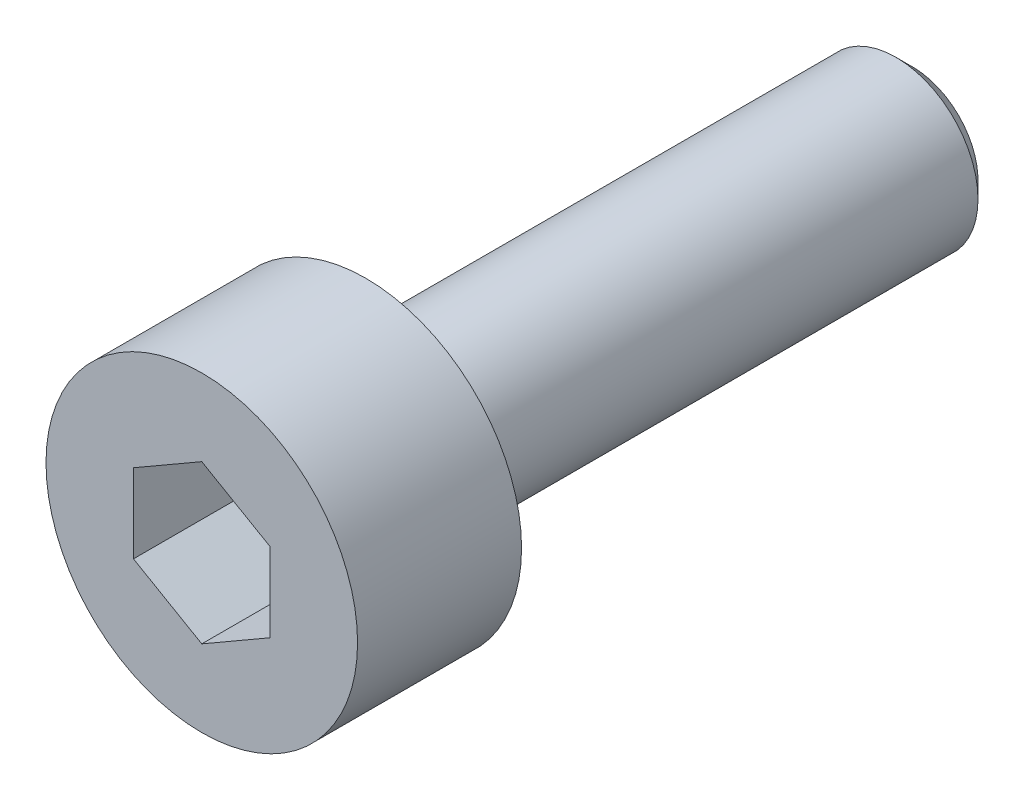
ISO-10303-21;
HEADER;
FILE_DESCRIPTION(('STEP AP214'),'2;1');
FILE_NAME('part.step','',(''),(''),'','','');
FILE_SCHEMA(('AUTOMOTIVE_DESIGN { 1 0 10303 214 1 1 1 1 }'));
ENDSEC;
DATA;
#1=APPLICATION_CONTEXT('core data for automotive mechanical design processes');
#2=APPLICATION_PROTOCOL_DEFINITION('international standard','automotive_design',2000,#1);
#3=PRODUCT_CONTEXT('',#1,'mechanical');
#4=PRODUCT('Part','Part','',(#3));
#5=PRODUCT_RELATED_PRODUCT_CATEGORY('part','',(#4));
#6=PRODUCT_DEFINITION_FORMATION('','',#4);
#7=PRODUCT_DEFINITION_CONTEXT('part definition',#1,'design');
#8=PRODUCT_DEFINITION('design','',#6,#7);
#9=PRODUCT_DEFINITION_SHAPE('','',#8);
#10=(LENGTH_UNIT() NAMED_UNIT(*) SI_UNIT(.MILLI.,.METRE.));
#11=(NAMED_UNIT(*) PLANE_ANGLE_UNIT() SI_UNIT($,.RADIAN.));
#12=(NAMED_UNIT(*) SI_UNIT($,.STERADIAN.) SOLID_ANGLE_UNIT());
#13=UNCERTAINTY_MEASURE_WITH_UNIT(LENGTH_MEASURE(1.E-05),#10,'distance_accuracy_value','');
#14=(GEOMETRIC_REPRESENTATION_CONTEXT(3) GLOBAL_UNCERTAINTY_ASSIGNED_CONTEXT((#13)) GLOBAL_UNIT_ASSIGNED_CONTEXT((#10,
#11,#12)) REPRESENTATION_CONTEXT('',''));
#15=CARTESIAN_POINT('',(0.,0.,0.));
#16=DIRECTION('',(0.,0.,1.));
#17=DIRECTION('',(1.,0.,0.));
#18=AXIS2_PLACEMENT_3D('',#15,#16,#17);
#19=CARTESIAN_POINT('',(0.,0.,0.));
#20=DIRECTION('',(0.,0.,1.));
#21=DIRECTION('',(1.,0.,0.));
#22=AXIS2_PLACEMENT_3D('',#19,#20,#21);
#23=PLANE('',#22);
#24=CARTESIAN_POINT('',(0.,0.,0.));
#25=DIRECTION('',(0.,0.,1.));
#26=DIRECTION('',(1.,0.,0.));
#27=AXIS2_PLACEMENT_3D('',#24,#25,#26);
#28=CIRCLE('',#27,2.85);
#29=CARTESIAN_POINT('',(2.85,0.,0.));
#30=VERTEX_POINT('',#29);
#31=EDGE_CURVE('E137',#30,#30,#28,.T.);
#32=ORIENTED_EDGE('',*,*,#31,.F.);
#33=EDGE_LOOP('',(#32));
#34=FACE_BOUND('',#33,.T.);
#35=CARTESIAN_POINT('',(0.,0.,0.));
#36=DIRECTION('',(0.,0.,1.));
#37=DIRECTION('',(1.,0.,0.));
#38=AXIS2_PLACEMENT_3D('',#35,#36,#37);
#39=CIRCLE('',#38,1.5);
#40=CARTESIAN_POINT('',(1.5,0.,0.));
#41=VERTEX_POINT('',#40);
#42=EDGE_CURVE('E146',#41,#41,#39,.F.);
#43=ORIENTED_EDGE('',*,*,#42,.F.);
#44=EDGE_LOOP('',(#43));
#45=FACE_BOUND('',#44,.T.);
#46=ADVANCED_FACE('F35',(#34,#45),#23,.F.);
#47=CARTESIAN_POINT('',(0.,0.,3.));
#48=DIRECTION('',(0.,0.,-1.));
#49=DIRECTION('',(-1.,0.,0.));
#50=AXIS2_PLACEMENT_3D('',#47,#48,#49);
#51=CYLINDRICAL_SURFACE('',#50,2.85);
#52=CARTESIAN_POINT('',(0.,0.,3.));
#53=DIRECTION('',(0.,0.,1.));
#54=DIRECTION('',(1.,0.,0.));
#55=AXIS2_PLACEMENT_3D('',#52,#53,#54);
#56=CIRCLE('',#55,2.85);
#57=CARTESIAN_POINT('',(2.85,0.,3.));
#58=VERTEX_POINT('',#57);
#59=EDGE_CURVE('E143',#58,#58,#56,.T.);
#60=ORIENTED_EDGE('',*,*,#59,.F.);
#61=EDGE_LOOP('',(#60));
#62=FACE_BOUND('',#61,.T.);
#63=ORIENTED_EDGE('',*,*,#31,.T.);
#64=EDGE_LOOP('',(#63));
#65=FACE_BOUND('',#64,.T.);
#66=ADVANCED_FACE('F168',(#62,#65),#51,.T.);
#67=CARTESIAN_POINT('',(0.,0.,3.));
#68=DIRECTION('',(0.,0.,1.));
#69=DIRECTION('',(1.,0.,0.));
#70=AXIS2_PLACEMENT_3D('',#67,#68,#69);
#71=PLANE('',#70);
#72=DIRECTION('',(-0.866025403784439,0.5,0.));
#73=VECTOR('',#72,1.);
#74=CARTESIAN_POINT('',(1.25,0.721687836487032,3.));
#75=LINE('',#74,#73);
#76=CARTESIAN_POINT('',(1.25,0.721687836487032,3.));
#77=VERTEX_POINT('',#76);
#78=CARTESIAN_POINT('',(0.,1.44337567297406,3.));
#79=VERTEX_POINT('',#78);
#80=EDGE_CURVE('E50',#77,#79,#75,.T.);
#81=ORIENTED_EDGE('',*,*,#80,.F.);
#82=DIRECTION('',(0.,1.,0.));
#83=VECTOR('',#82,1.);
#84=CARTESIAN_POINT('',(1.25,-0.721687836487032,3.));
#85=LINE('',#84,#83);
#86=CARTESIAN_POINT('',(1.25,-0.721687836487032,3.));
#87=VERTEX_POINT('',#86);
#88=EDGE_CURVE('E133',#87,#77,#85,.T.);
#89=ORIENTED_EDGE('',*,*,#88,.F.);
#90=DIRECTION('',(0.866025403784439,0.5,0.));
#91=VECTOR('',#90,1.);
#92=CARTESIAN_POINT('',(0.,-1.44337567297406,3.));
#93=LINE('',#92,#91);
#94=CARTESIAN_POINT('',(0.,-1.44337567297406,3.));
#95=VERTEX_POINT('',#94);
#96=EDGE_CURVE('E131',#95,#87,#93,.T.);
#97=ORIENTED_EDGE('',*,*,#96,.F.);
#98=DIRECTION('',(0.866025403784439,-0.5,0.));
#99=VECTOR('',#98,1.);
#100=CARTESIAN_POINT('',(-1.25,-0.721687836487033,3.));
#101=LINE('',#100,#99);
#102=CARTESIAN_POINT('',(-1.25,-0.721687836487033,3.));
#103=VERTEX_POINT('',#102);
#104=EDGE_CURVE('E98',#103,#95,#101,.T.);
#105=ORIENTED_EDGE('',*,*,#104,.F.);
#106=DIRECTION('',(0.,-1.,0.));
#107=VECTOR('',#106,1.);
#108=CARTESIAN_POINT('',(-1.25,0.721687836487032,3.));
#109=LINE('',#108,#107);
#110=CARTESIAN_POINT('',(-1.25,0.721687836487032,3.));
#111=VERTEX_POINT('',#110);
#112=EDGE_CURVE('E127',#111,#103,#109,.T.);
#113=ORIENTED_EDGE('',*,*,#112,.F.);
#114=DIRECTION('',(-0.866025403784439,-0.5,0.));
#115=VECTOR('',#114,1.);
#116=CARTESIAN_POINT('',(0.,1.44337567297406,3.));
#117=LINE('',#116,#115);
#118=EDGE_CURVE('E124',#79,#111,#117,.T.);
#119=ORIENTED_EDGE('',*,*,#118,.F.);
#120=EDGE_LOOP('',(#81,#89,#97,#105,#113,#119));
#121=FACE_BOUND('',#120,.T.);
#122=ORIENTED_EDGE('',*,*,#59,.T.);
#123=EDGE_LOOP('',(#122));
#124=FACE_BOUND('',#123,.T.);
#125=ADVANCED_FACE('F174',(#121,#124),#71,.T.);
#126=CARTESIAN_POINT('',(0.,0.,-10.));
#127=DIRECTION('',(0.,0.,1.));
#128=DIRECTION('',(1.,0.,0.));
#129=AXIS2_PLACEMENT_3D('',#126,#127,#128);
#130=CYLINDRICAL_SURFACE('',#129,1.5);
#131=CARTESIAN_POINT('',(0.,0.,-9.7));
#132=DIRECTION('',(0.,0.,-1.));
#133=DIRECTION('',(-1.,0.,0.));
#134=AXIS2_PLACEMENT_3D('',#131,#132,#133);
#135=CIRCLE('',#134,1.5);
#136=CARTESIAN_POINT('',(-1.5,0.,-9.7));
#137=VERTEX_POINT('',#136);
#138=EDGE_CURVE('E11',#137,#137,#135,.F.);
#139=ORIENTED_EDGE('',*,*,#138,.T.);
#140=EDGE_LOOP('',(#139));
#141=FACE_BOUND('',#140,.T.);
#142=ORIENTED_EDGE('',*,*,#42,.T.);
#143=EDGE_LOOP('',(#142));
#144=FACE_BOUND('',#143,.T.);
#145=ADVANCED_FACE('F164',(#141,#144),#130,.T.);
#146=CARTESIAN_POINT('',(0.,0.,-10.));
#147=DIRECTION('',(0.,0.,-1.));
#148=DIRECTION('',(-1.,0.,0.));
#149=AXIS2_PLACEMENT_3D('',#146,#147,#148);
#150=PLANE('',#149);
#151=CARTESIAN_POINT('',(0.,0.,-10.));
#152=DIRECTION('',(0.,0.,-1.));
#153=DIRECTION('',(-1.,0.,0.));
#154=AXIS2_PLACEMENT_3D('',#151,#152,#153);
#155=CIRCLE('',#154,1.2);
#156=CARTESIAN_POINT('',(-1.2,0.,-10.));
#157=VERTEX_POINT('',#156);
#158=EDGE_CURVE('E43',#157,#157,#155,.T.);
#159=ORIENTED_EDGE('',*,*,#158,.T.);
#160=EDGE_LOOP('',(#159));
#161=FACE_BOUND('',#160,.T.);
#162=ADVANCED_FACE('F153',(#161),#150,.T.);
#163=CARTESIAN_POINT('',(0.,0.,-10.));
#164=DIRECTION('',(0.,0.,1.));
#165=DIRECTION('',(1.,0.,0.));
#166=AXIS2_PLACEMENT_3D('',#163,#164,#165);
#167=CONICAL_SURFACE('',#166,1.2,0.785398163397444);
#168=ORIENTED_EDGE('',*,*,#138,.F.);
#169=EDGE_LOOP('',(#168));
#170=FACE_BOUND('',#169,.T.);
#171=ORIENTED_EDGE('',*,*,#158,.F.);
#172=EDGE_LOOP('',(#171));
#173=FACE_BOUND('',#172,.T.);
#174=ADVANCED_FACE('F37',(#170,#173),#167,.T.);
#175=CARTESIAN_POINT('',(1.25,0.721687836487032,1.));
#176=DIRECTION('',(0.5,0.866025403784439,0.));
#177=DIRECTION('',(-0.866025403784439,0.5,0.));
#178=AXIS2_PLACEMENT_3D('',#175,#176,#177);
#179=PLANE('',#178);
#180=ORIENTED_EDGE('',*,*,#80,.T.);
#181=DIRECTION('',(0.,0.,1.));
#182=VECTOR('',#181,1.);
#183=CARTESIAN_POINT('',(0.,1.44337567297406,1.));
#184=LINE('',#183,#182);
#185=CARTESIAN_POINT('',(0.,1.44337567297406,1.));
#186=VERTEX_POINT('',#185);
#187=EDGE_CURVE('E80',#186,#79,#184,.T.);
#188=ORIENTED_EDGE('',*,*,#187,.F.);
#189=DIRECTION('',(-0.866025403784439,0.5,0.));
#190=VECTOR('',#189,1.);
#191=CARTESIAN_POINT('',(1.25,0.721687836487032,1.));
#192=LINE('',#191,#190);
#193=CARTESIAN_POINT('',(1.25,0.721687836487032,1.));
#194=VERTEX_POINT('',#193);
#195=EDGE_CURVE('E135',#194,#186,#192,.T.);
#196=ORIENTED_EDGE('',*,*,#195,.F.);
#197=DIRECTION('',(0.,0.,1.));
#198=VECTOR('',#197,1.);
#199=CARTESIAN_POINT('',(1.25,0.721687836487032,1.));
#200=LINE('',#199,#198);
#201=EDGE_CURVE('E58',#194,#77,#200,.T.);
#202=ORIENTED_EDGE('',*,*,#201,.T.);
#203=EDGE_LOOP('',(#180,#188,#196,#202));
#204=FACE_BOUND('',#203,.T.);
#205=ADVANCED_FACE('F156',(#204),#179,.F.);
#206=CARTESIAN_POINT('',(1.25,-0.721687836487032,1.));
#207=DIRECTION('',(1.,0.,0.));
#208=DIRECTION('',(0.,1.,0.));
#209=AXIS2_PLACEMENT_3D('',#206,#207,#208);
#210=PLANE('',#209);
#211=ORIENTED_EDGE('',*,*,#88,.T.);
#212=ORIENTED_EDGE('',*,*,#201,.F.);
#213=DIRECTION('',(0.,1.,0.));
#214=VECTOR('',#213,1.);
#215=CARTESIAN_POINT('',(1.25,-0.721687836487032,1.));
#216=LINE('',#215,#214);
#217=CARTESIAN_POINT('',(1.25,-0.721687836487032,1.));
#218=VERTEX_POINT('',#217);
#219=EDGE_CURVE('E110',#218,#194,#216,.T.);
#220=ORIENTED_EDGE('',*,*,#219,.F.);
#221=DIRECTION('',(0.,0.,1.));
#222=VECTOR('',#221,1.);
#223=CARTESIAN_POINT('',(1.25,-0.721687836487032,1.));
#224=LINE('',#223,#222);
#225=EDGE_CURVE('E102',#218,#87,#224,.T.);
#226=ORIENTED_EDGE('',*,*,#225,.T.);
#227=EDGE_LOOP('',(#211,#212,#220,#226));
#228=FACE_BOUND('',#227,.T.);
#229=ADVANCED_FACE('F162',(#228),#210,.F.);
#230=CARTESIAN_POINT('',(0.,-1.44337567297406,1.));
#231=DIRECTION('',(0.5,-0.866025403784439,0.));
#232=DIRECTION('',(0.866025403784439,0.5,0.));
#233=AXIS2_PLACEMENT_3D('',#230,#231,#232);
#234=PLANE('',#233);
#235=ORIENTED_EDGE('',*,*,#96,.T.);
#236=ORIENTED_EDGE('',*,*,#225,.F.);
#237=DIRECTION('',(0.866025403784439,0.5,0.));
#238=VECTOR('',#237,1.);
#239=CARTESIAN_POINT('',(0.,-1.44337567297406,1.));
#240=LINE('',#239,#238);
#241=CARTESIAN_POINT('',(0.,-1.44337567297406,1.));
#242=VERTEX_POINT('',#241);
#243=EDGE_CURVE('E106',#242,#218,#240,.T.);
#244=ORIENTED_EDGE('',*,*,#243,.F.);
#245=DIRECTION('',(0.,0.,1.));
#246=VECTOR('',#245,1.);
#247=CARTESIAN_POINT('',(0.,-1.44337567297406,1.));
#248=LINE('',#247,#246);
#249=EDGE_CURVE('E91',#242,#95,#248,.T.);
#250=ORIENTED_EDGE('',*,*,#249,.T.);
#251=EDGE_LOOP('',(#235,#236,#244,#250));
#252=FACE_BOUND('',#251,.T.);
#253=ADVANCED_FACE('F107',(#252),#234,.F.);
#254=CARTESIAN_POINT('',(-1.25,-0.721687836487033,1.));
#255=DIRECTION('',(-0.5,-0.866025403784439,0.));
#256=DIRECTION('',(0.866025403784439,-0.5,0.));
#257=AXIS2_PLACEMENT_3D('',#254,#255,#256);
#258=PLANE('',#257);
#259=ORIENTED_EDGE('',*,*,#104,.T.);
#260=ORIENTED_EDGE('',*,*,#249,.F.);
#261=DIRECTION('',(0.866025403784439,-0.5,0.));
#262=VECTOR('',#261,1.);
#263=CARTESIAN_POINT('',(-1.25,-0.721687836487033,1.));
#264=LINE('',#263,#262);
#265=CARTESIAN_POINT('',(-1.25,-0.721687836487033,1.));
#266=VERTEX_POINT('',#265);
#267=EDGE_CURVE('E95',#266,#242,#264,.T.);
#268=ORIENTED_EDGE('',*,*,#267,.F.);
#269=DIRECTION('',(0.,0.,1.));
#270=VECTOR('',#269,1.);
#271=CARTESIAN_POINT('',(-1.25,-0.721687836487033,1.));
#272=LINE('',#271,#270);
#273=EDGE_CURVE('E103',#266,#103,#272,.T.);
#274=ORIENTED_EDGE('',*,*,#273,.T.);
#275=EDGE_LOOP('',(#259,#260,#268,#274));
#276=FACE_BOUND('',#275,.T.);
#277=ADVANCED_FACE('F93',(#276),#258,.F.);
#278=CARTESIAN_POINT('',(-1.25,0.721687836487032,1.));
#279=DIRECTION('',(-1.,0.,0.));
#280=DIRECTION('',(0.,0.,1.));
#281=AXIS2_PLACEMENT_3D('',#278,#279,#280);
#282=PLANE('',#281);
#283=ORIENTED_EDGE('',*,*,#112,.T.);
#284=ORIENTED_EDGE('',*,*,#273,.F.);
#285=DIRECTION('',(0.,-1.,0.));
#286=VECTOR('',#285,1.);
#287=CARTESIAN_POINT('',(-1.25,0.721687836487032,1.));
#288=LINE('',#287,#286);
#289=CARTESIAN_POINT('',(-1.25,0.721687836487032,1.));
#290=VERTEX_POINT('',#289);
#291=EDGE_CURVE('E116',#290,#266,#288,.T.);
#292=ORIENTED_EDGE('',*,*,#291,.F.);
#293=DIRECTION('',(0.,0.,1.));
#294=VECTOR('',#293,1.);
#295=CARTESIAN_POINT('',(-1.25,0.721687836487032,1.));
#296=LINE('',#295,#294);
#297=EDGE_CURVE('E140',#290,#111,#296,.T.);
#298=ORIENTED_EDGE('',*,*,#297,.T.);
#299=EDGE_LOOP('',(#283,#284,#292,#298));
#300=FACE_BOUND('',#299,.T.);
#301=ADVANCED_FACE('F188',(#300),#282,.F.);
#302=CARTESIAN_POINT('',(0.,1.44337567297406,1.));
#303=DIRECTION('',(-0.5,0.866025403784439,0.));
#304=DIRECTION('',(-0.866025403784439,-0.5,0.));
#305=AXIS2_PLACEMENT_3D('',#302,#303,#304);
#306=PLANE('',#305);
#307=ORIENTED_EDGE('',*,*,#118,.T.);
#308=ORIENTED_EDGE('',*,*,#297,.F.);
#309=DIRECTION('',(-0.866025403784439,-0.5,0.));
#310=VECTOR('',#309,1.);
#311=CARTESIAN_POINT('',(0.,1.44337567297406,1.));
#312=LINE('',#311,#310);
#313=EDGE_CURVE('E118',#186,#290,#312,.T.);
#314=ORIENTED_EDGE('',*,*,#313,.F.);
#315=ORIENTED_EDGE('',*,*,#187,.T.);
#316=EDGE_LOOP('',(#307,#308,#314,#315));
#317=FACE_BOUND('',#316,.T.);
#318=ADVANCED_FACE('F185',(#317),#306,.F.);
#319=CARTESIAN_POINT('',(0.,0.,1.));
#320=DIRECTION('',(0.,0.,1.));
#321=DIRECTION('',(1.,0.,0.));
#322=AXIS2_PLACEMENT_3D('',#319,#320,#321);
#323=PLANE('',#322);
#324=ORIENTED_EDGE('',*,*,#195,.T.);
#325=ORIENTED_EDGE('',*,*,#313,.T.);
#326=ORIENTED_EDGE('',*,*,#291,.T.);
#327=ORIENTED_EDGE('',*,*,#267,.T.);
#328=ORIENTED_EDGE('',*,*,#243,.T.);
#329=ORIENTED_EDGE('',*,*,#219,.T.);
#330=EDGE_LOOP('',(#324,#325,#326,#327,#328,#329));
#331=FACE_BOUND('',#330,.T.);
#332=ADVANCED_FACE('F113',(#331),#323,.T.);
#333=CLOSED_SHELL('',(#46,#66,#125,#145,#162,#174,#205,#229,#253,#277,#301,#318,#332));
#334=MANIFOLD_SOLID_BREP('B2',#333);
#335=ADVANCED_BREP_SHAPE_REPRESENTATION('',(#18,#334),#14);
#336=SHAPE_DEFINITION_REPRESENTATION(#9,#335);
ENDSEC;
END-ISO-10303-21;
